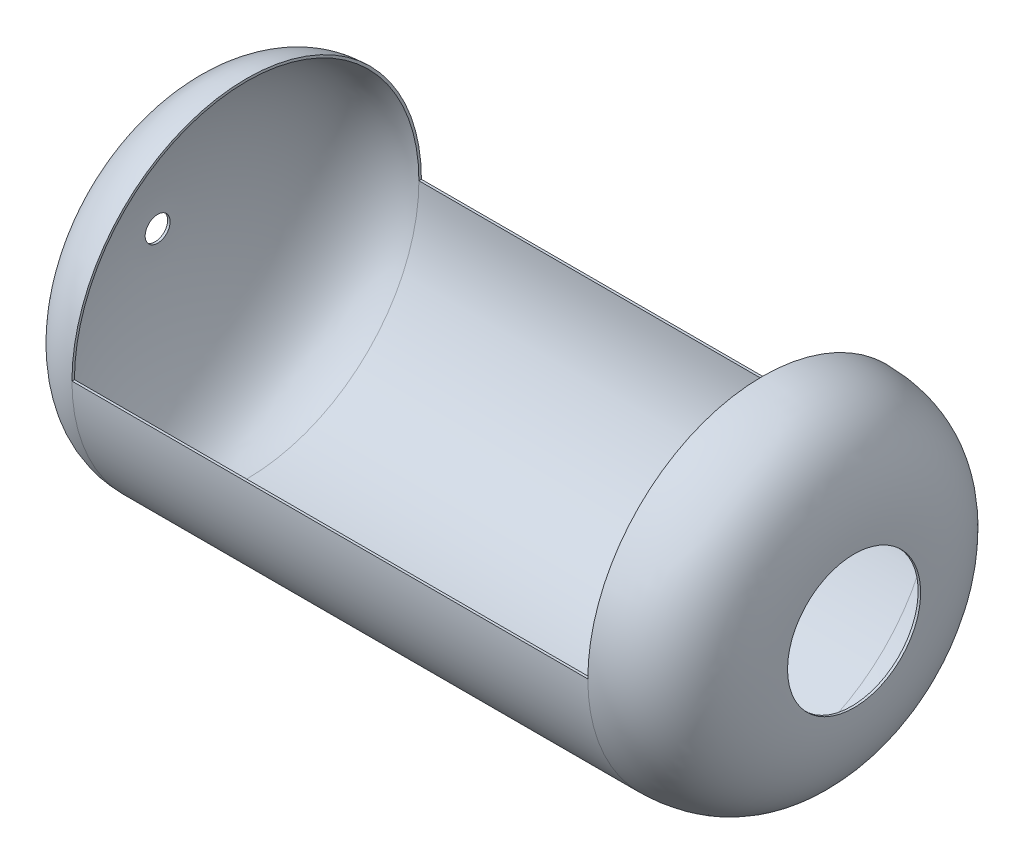
ISO-10303-21;
HEADER;
FILE_DESCRIPTION(('STEP AP214'),'2;1');
FILE_NAME('part.step','',(''),(''),'','','');
FILE_SCHEMA(('AUTOMOTIVE_DESIGN { 1 0 10303 214 1 1 1 1 }'));
ENDSEC;
DATA;
#1=APPLICATION_CONTEXT('core data for automotive mechanical design processes');
#2=APPLICATION_PROTOCOL_DEFINITION('international standard','automotive_design',2000,#1);
#3=PRODUCT_CONTEXT('',#1,'mechanical');
#4=PRODUCT('Part','Part','',(#3));
#5=PRODUCT_RELATED_PRODUCT_CATEGORY('part','',(#4));
#6=PRODUCT_DEFINITION_FORMATION('','',#4);
#7=PRODUCT_DEFINITION_CONTEXT('part definition',#1,'design');
#8=PRODUCT_DEFINITION('design','',#6,#7);
#9=PRODUCT_DEFINITION_SHAPE('','',#8);
#10=(LENGTH_UNIT() NAMED_UNIT(*) SI_UNIT(.MILLI.,.METRE.));
#11=(NAMED_UNIT(*) PLANE_ANGLE_UNIT() SI_UNIT($,.RADIAN.));
#12=(NAMED_UNIT(*) SI_UNIT($,.STERADIAN.) SOLID_ANGLE_UNIT());
#13=UNCERTAINTY_MEASURE_WITH_UNIT(LENGTH_MEASURE(1.E-05),#10,'distance_accuracy_value','');
#14=(GEOMETRIC_REPRESENTATION_CONTEXT(3) GLOBAL_UNCERTAINTY_ASSIGNED_CONTEXT((#13)) GLOBAL_UNIT_ASSIGNED_CONTEXT((#10,
#11,#12)) REPRESENTATION_CONTEXT('',''));
#15=CARTESIAN_POINT('',(0.,0.,0.));
#16=DIRECTION('',(0.,0.,1.));
#17=DIRECTION('',(1.,0.,0.));
#18=AXIS2_PLACEMENT_3D('',#15,#16,#17);
#19=CARTESIAN_POINT('',(-396.592099755992,0.,312.435963201851));
#20=DIRECTION('',(-1.,0.,0.));
#21=DIRECTION('',(0.,0.,1.));
#22=AXIS2_PLACEMENT_3D('',#19,#20,#21);
#23=CYLINDRICAL_SURFACE('',#22,210.);
#24=DIRECTION('',(-1.,0.,0.));
#25=VECTOR('',#24,1.);
#26=CARTESIAN_POINT('',(-396.592099755992,0.,102.435963201851));
#27=LINE('',#26,#25);
#28=CARTESIAN_POINT('',(581.58387703481,0.,102.435963201851));
#29=VERTEX_POINT('',#28);
#30=CARTESIAN_POINT('',(-38.4161229651903,0.,102.435963201851));
#31=VERTEX_POINT('',#30);
#32=EDGE_CURVE('E102',#29,#31,#27,.T.);
#33=ORIENTED_EDGE('',*,*,#32,.F.);
#34=CARTESIAN_POINT('',(581.58387703481,0.,312.435963201851));
#35=DIRECTION('',(-1.,0.,0.));
#36=DIRECTION('',(0.,0.,1.));
#37=AXIS2_PLACEMENT_3D('',#34,#35,#36);
#38=CIRCLE('',#37,210.);
#39=CARTESIAN_POINT('',(581.58387703481,0.,522.435963201851));
#40=VERTEX_POINT('',#39);
#41=EDGE_CURVE('E100',#29,#40,#38,.T.);
#42=ORIENTED_EDGE('',*,*,#41,.T.);
#43=DIRECTION('',(-1.,0.,0.));
#44=VECTOR('',#43,1.);
#45=CARTESIAN_POINT('',(-396.592099755992,0.,522.435963201851));
#46=LINE('',#45,#44);
#47=CARTESIAN_POINT('',(-38.4161229651903,0.,522.435963201851));
#48=VERTEX_POINT('',#47);
#49=EDGE_CURVE('E90',#48,#40,#46,.F.);
#50=ORIENTED_EDGE('',*,*,#49,.F.);
#51=CARTESIAN_POINT('',(-38.4161229651903,0.,312.435963201851));
#52=DIRECTION('',(-1.,0.,0.));
#53=DIRECTION('',(0.,0.,1.));
#54=AXIS2_PLACEMENT_3D('',#51,#52,#53);
#55=CIRCLE('',#54,210.);
#56=EDGE_CURVE('E86',#31,#48,#55,.T.);
#57=ORIENTED_EDGE('',*,*,#56,.F.);
#58=EDGE_LOOP('',(#33,#42,#50,#57));
#59=FACE_BOUND('',#58,.T.);
#60=ADVANCED_FACE('F33',(#59),#23,.T.);
#61=CARTESIAN_POINT('',(581.572240946435,0.,105.435963201855));
#62=CARTESIAN_POINT('',(582.424150652376,0.,105.442600659164));
#63=CARTESIAN_POINT('',(584.137918536488,0.,105.468851394561));
#64=CARTESIAN_POINT('',(587.484086921425,0.,105.571526795944));
#65=CARTESIAN_POINT('',(591.571096113027,0.,105.792916991487));
#66=CARTESIAN_POINT('',(596.307608868529,0.,106.202626940194));
#67=CARTESIAN_POINT('',(602.409126826052,0.,106.934758125947));
#68=CARTESIAN_POINT('',(609.639419086535,0.,108.18665602962));
#69=CARTESIAN_POINT('',(617.70585707123,0.,110.190510235831));
#70=CARTESIAN_POINT('',(625.186745255784,0.,112.659295821792));
#71=CARTESIAN_POINT('',(634.414245375346,0.,116.523312816482));
#72=CARTESIAN_POINT('',(644.61207372756,0.,122.339029978004));
#73=CARTESIAN_POINT('',(654.913796391652,0.,130.630357057189));
#74=CARTESIAN_POINT('',(663.46928585493,0.,139.982021209339));
#75=CARTESIAN_POINT('',(670.45039121658,0.,150.141502012286));
#76=CARTESIAN_POINT('',(676.016737994154,0.,160.847618744532));
#77=CARTESIAN_POINT('',(680.323342135693,0.,171.82903786729));
#78=CARTESIAN_POINT('',(683.525745860682,0.,182.806951111899));
#79=CARTESIAN_POINT('',(685.782094183419,0.,193.498408860527));
#80=CARTESIAN_POINT('',(687.253383878059,0.,203.618874423817));
#81=CARTESIAN_POINT('',(687.961369137142,0.,211.33978533163));
#82=CARTESIAN_POINT('',(688.299442483134,0.,216.947462036163));
#83=CARTESIAN_POINT('',(688.459593049096,0.,220.834002423392));
#84=CARTESIAN_POINT('',(688.547117141363,0.,224.365875374698));
#85=CARTESIAN_POINT('',(688.582824388612,0.,227.512914090602));
#86=CARTESIAN_POINT('',(688.586742369723,0.,229.777140480908));
#87=CARTESIAN_POINT('',(688.584795316882,0.,231.383827188645));
#88=CARTESIAN_POINT('',(688.583877034809,0.,232.075985648928));
#89=CARTESIAN_POINT('',(688.583877034809,0.,232.435963191891));
#90=B_SPLINE_CURVE_WITH_KNOTS('',3,(#61,#62,#63,#64,#65,#66,#67,#68,#69,#70,#71,#72,#73,#74,#75,
#76,#77,#78,#79,#80,#81,#82,#83,#84,#85,#86,#87,#88,#89),.UNSPECIFIED.,.F.,.F.,(4,1,1,1,1,1,1,1,
1,1,1,1,1,1,1,1,1,1,1,1,1,1,1,1,1,1,4),(3.49728876252685E-05,0.0078471996619407,
0.0156594264362561,0.031283879984887,0.0469083335335178,0.0625327870821487,0.0937816941794104,
0.125030601276672,0.156279508373934,0.187528415471196,0.250026229665719,0.312524043860242,
0.375021858054766,0.437519672249289,0.500017486443813,0.562515300638336,0.625013114832859,
0.687510929027383,0.750008743221906,0.81250655741643,0.843755464513691,0.875004371610953,
0.906253278708215,0.937502185805477,0.968751092902738,0.984375546451369,1.),.UNSPECIFIED.);
#91=CARTESIAN_POINT('',(-396.592099755992,0.,312.435963201851));
#92=DIRECTION('',(-1.,0.,0.));
#93=AXIS1_PLACEMENT('',#91,#92);
#94=SURFACE_OF_REVOLUTION('',#90,#93);
#95=CARTESIAN_POINT('',(688.583877034809,0.,312.435963201851));
#96=DIRECTION('',(-1.,0.,0.));
#97=DIRECTION('',(0.,0.,1.));
#98=AXIS2_PLACEMENT_3D('',#95,#96,#97);
#99=CIRCLE('',#98,80.0000000099596);
#100=CARTESIAN_POINT('',(688.583877034809,0.,392.43596321181));
#101=VERTEX_POINT('',#100);
#102=EDGE_CURVE('E111',#101,#101,#99,.T.);
#103=ORIENTED_EDGE('',*,*,#102,.F.);
#104=EDGE_LOOP('',(#103));
#105=FACE_BOUND('',#104,.T.);
#106=CARTESIAN_POINT('',(581.572240946435,0.,105.435963201855));
#107=CARTESIAN_POINT('',(582.424150652376,0.,105.442600659164));
#108=CARTESIAN_POINT('',(584.137918536488,0.,105.468851394561));
#109=CARTESIAN_POINT('',(587.484086921425,0.,105.571526795944));
#110=CARTESIAN_POINT('',(591.571096113027,0.,105.792916991487));
#111=CARTESIAN_POINT('',(596.307608868529,0.,106.202626940194));
#112=CARTESIAN_POINT('',(602.409126826052,0.,106.934758125947));
#113=CARTESIAN_POINT('',(609.639419086535,0.,108.18665602962));
#114=CARTESIAN_POINT('',(617.70585707123,0.,110.190510235831));
#115=CARTESIAN_POINT('',(625.186745255784,0.,112.659295821792));
#116=CARTESIAN_POINT('',(634.414245375346,0.,116.523312816482));
#117=CARTESIAN_POINT('',(644.61207372756,0.,122.339029978004));
#118=CARTESIAN_POINT('',(654.913796391652,0.,130.630357057189));
#119=CARTESIAN_POINT('',(663.46928585493,0.,139.982021209339));
#120=CARTESIAN_POINT('',(670.45039121658,0.,150.141502012286));
#121=CARTESIAN_POINT('',(676.016737994154,0.,160.847618744532));
#122=CARTESIAN_POINT('',(680.323342135693,0.,171.82903786729));
#123=CARTESIAN_POINT('',(683.525745860682,0.,182.806951111899));
#124=CARTESIAN_POINT('',(685.782094183419,0.,193.498408860527));
#125=CARTESIAN_POINT('',(687.253383878059,0.,203.618874423817));
#126=CARTESIAN_POINT('',(687.961369137142,0.,211.33978533163));
#127=CARTESIAN_POINT('',(688.299442483134,0.,216.947462036163));
#128=CARTESIAN_POINT('',(688.459593049096,0.,220.834002423392));
#129=CARTESIAN_POINT('',(688.547117141363,0.,224.365875374698));
#130=CARTESIAN_POINT('',(688.582824388612,0.,227.512914090602));
#131=CARTESIAN_POINT('',(688.586742369723,0.,229.777140480908));
#132=CARTESIAN_POINT('',(688.584795316882,0.,231.383827188645));
#133=CARTESIAN_POINT('',(688.583877034809,0.,232.075985648928));
#134=CARTESIAN_POINT('',(688.583877034809,0.,232.435963191891));
#135=B_SPLINE_CURVE_WITH_KNOTS('',3,(#106,#107,#108,#109,#110,#111,#112,#113,#114,#115,#116,
#117,#118,#119,#120,#121,#122,#123,#124,#125,#126,#127,#128,#129,#130,#131,#132,#133,#134),
.UNSPECIFIED.,.F.,.F.,(4,1,1,1,1,1,1,1,1,1,1,1,1,1,1,1,1,1,1,1,1,1,1,1,1,1,4),
(3.49728876252685E-05,0.0078471996619407,0.0156594264362561,0.031283879984887,
0.0469083335335178,0.0625327870821487,0.0937816941794104,0.125030601276672,0.156279508373934,
0.187528415471196,0.250026229665719,0.312524043860242,0.375021858054766,0.437519672249289,
0.500017486443813,0.562515300638336,0.625013114832859,0.687510929027383,0.750008743221906,
0.81250655741643,0.843755464513691,0.875004371610953,0.906253278708215,0.937502185805477,
0.968751092902738,0.984375546451369,1.),.UNSPECIFIED.);
#136=CARTESIAN_POINT('',(581.572240946435,0.,105.435966502601));
#137=VERTEX_POINT('',#136);
#138=CARTESIAN_POINT('',(581.58387703481,0.,105.436054262773));
#139=VERTEX_POINT('',#138);
#140=EDGE_CURVE('E103',#137,#139,#135,.T.);
#141=ORIENTED_EDGE('',*,*,#140,.F.);
#142=CARTESIAN_POINT('',(581.572240946435,0.,312.435963201851));
#143=DIRECTION('',(-1.,0.,0.));
#144=DIRECTION('',(0.,0.,1.));
#145=AXIS2_PLACEMENT_3D('',#142,#143,#144);
#146=CIRCLE('',#145,206.999999999996);
#147=CARTESIAN_POINT('',(581.572240946435,0.,519.4359599011));
#148=VERTEX_POINT('',#147);
#149=EDGE_CURVE('E114',#137,#148,#146,.T.);
#150=ORIENTED_EDGE('',*,*,#149,.T.);
#151=CARTESIAN_POINT('',(581.572240946435,0.,519.435963201847));
#152=CARTESIAN_POINT('',(582.424150652376,0.,519.429325744537));
#153=CARTESIAN_POINT('',(584.137918536488,0.,519.40307500914));
#154=CARTESIAN_POINT('',(587.484086921425,0.,519.300399607757));
#155=CARTESIAN_POINT('',(591.571096113027,0.,519.079009412215));
#156=CARTESIAN_POINT('',(596.307608868529,0.,518.669299463507));
#157=CARTESIAN_POINT('',(602.409126826052,0.,517.937168277754));
#158=CARTESIAN_POINT('',(609.639419086535,0.,516.685270374081));
#159=CARTESIAN_POINT('',(617.70585707123,0.,514.68141616787));
#160=CARTESIAN_POINT('',(625.186745255784,0.,512.212630581909));
#161=CARTESIAN_POINT('',(634.414245375346,0.,508.34861358722));
#162=CARTESIAN_POINT('',(644.61207372756,0.,502.532896425697));
#163=CARTESIAN_POINT('',(654.913796391652,0.,494.241569346513));
#164=CARTESIAN_POINT('',(663.46928585493,0.,484.889905194362));
#165=CARTESIAN_POINT('',(670.45039121658,0.,474.730424391415));
#166=CARTESIAN_POINT('',(676.016737994154,0.,464.024307659169));
#167=CARTESIAN_POINT('',(680.323342135693,0.,453.042888536411));
#168=CARTESIAN_POINT('',(683.525745860682,0.,442.064975291802));
#169=CARTESIAN_POINT('',(685.782094183419,0.,431.373517543175));
#170=CARTESIAN_POINT('',(687.253383878059,0.,421.253051979885));
#171=CARTESIAN_POINT('',(687.961369137142,0.,413.532141072071));
#172=CARTESIAN_POINT('',(688.299442483134,0.,407.924464367538));
#173=CARTESIAN_POINT('',(688.459593049096,0.,404.03792398031));
#174=CARTESIAN_POINT('',(688.547117141363,0.,400.506051029004));
#175=CARTESIAN_POINT('',(688.582824388612,0.,397.359012313099));
#176=CARTESIAN_POINT('',(688.586742369723,0.,395.094785922793));
#177=CARTESIAN_POINT('',(688.584795316882,0.,393.488099215056));
#178=CARTESIAN_POINT('',(688.583877034809,0.,392.795940754773));
#179=CARTESIAN_POINT('',(688.583877034809,0.,392.43596321181));
#180=B_SPLINE_CURVE_WITH_KNOTS('',3,(#151,#152,#153,#154,#155,#156,#157,#158,#159,#160,#161,
#162,#163,#164,#165,#166,#167,#168,#169,#170,#171,#172,#173,#174,#175,#176,#177,#178,#179),
.UNSPECIFIED.,.F.,.F.,(4,1,1,1,1,1,1,1,1,1,1,1,1,1,1,1,1,1,1,1,1,1,1,1,1,1,4),
(3.49728876252685E-05,0.0078471996619407,0.0156594264362561,0.031283879984887,
0.0469083335335178,0.0625327870821487,0.0937816941794104,0.125030601276672,0.156279508373934,
0.187528415471196,0.250026229665719,0.312524043860242,0.375021858054766,0.437519672249289,
0.500017486443813,0.562515300638336,0.625013114832859,0.687510929027383,0.750008743221906,
0.81250655741643,0.843755464513691,0.875004371610953,0.906253278708215,0.937502185805477,
0.968751092902738,0.984375546451369,1.),.UNSPECIFIED.);
#181=CARTESIAN_POINT('',(581.58387703481,0.,519.435872140929));
#182=VERTEX_POINT('',#181);
#183=EDGE_CURVE('E187',#182,#148,#180,.F.);
#184=ORIENTED_EDGE('',*,*,#183,.F.);
#185=CARTESIAN_POINT('',(581.58387703481,0.,312.435963201851));
#186=DIRECTION('',(-1.,0.,0.));
#187=DIRECTION('',(0.,0.,1.));
#188=AXIS2_PLACEMENT_3D('',#185,#186,#187);
#189=CIRCLE('',#188,206.999908939078);
#190=EDGE_CURVE('E11',#182,#139,#189,.T.);
#191=ORIENTED_EDGE('',*,*,#190,.T.);
#192=EDGE_LOOP('',(#141,#150,#184,#191));
#193=FACE_BOUND('',#192,.T.);
#194=ADVANCED_FACE('F145',(#105,#193),#94,.T.);
#195=CARTESIAN_POINT('',(-396.592099755992,0.,312.435963201851));
#196=DIRECTION('',(-1.,0.,0.));
#197=DIRECTION('',(0.,0.,1.));
#198=AXIS2_PLACEMENT_3D('',#195,#196,#197);
#199=CYLINDRICAL_SURFACE('',#198,206.999996699249);
#200=DIRECTION('',(-1.,0.,0.));
#201=VECTOR('',#200,1.);
#202=CARTESIAN_POINT('',(-396.592099755992,0.,105.435966502601));
#203=LINE('',#202,#201);
#204=CARTESIAN_POINT('',(-38.4161229511558,0.,105.435969803348));
#205=VERTEX_POINT('',#204);
#206=EDGE_CURVE('E182',#205,#137,#203,.F.);
#207=ORIENTED_EDGE('',*,*,#206,.F.);
#208=CARTESIAN_POINT('',(-38.4161229511558,0.,312.435963201851));
#209=DIRECTION('',(-1.,0.,0.));
#210=DIRECTION('',(0.,0.,1.));
#211=AXIS2_PLACEMENT_3D('',#208,#209,#210);
#212=CIRCLE('',#211,206.999993398502);
#213=CARTESIAN_POINT('',(-38.4161229511558,0.,519.435956600353));
#214=VERTEX_POINT('',#213);
#215=EDGE_CURVE('E119',#205,#214,#212,.T.);
#216=ORIENTED_EDGE('',*,*,#215,.T.);
#217=DIRECTION('',(-1.,0.,0.));
#218=VECTOR('',#217,1.);
#219=CARTESIAN_POINT('',(-396.592099755992,0.,519.4359599011));
#220=LINE('',#219,#218);
#221=EDGE_CURVE('E93',#148,#214,#220,.T.);
#222=ORIENTED_EDGE('',*,*,#221,.F.);
#223=ORIENTED_EDGE('',*,*,#149,.F.);
#224=EDGE_LOOP('',(#207,#216,#222,#223));
#225=FACE_BOUND('',#224,.T.);
#226=ADVANCED_FACE('F149',(#225),#199,.F.);
#227=CARTESIAN_POINT('',(-38.4161229651902,0.,102.435963201851));
#228=CARTESIAN_POINT('',(-139.444928362584,0.,102.644054250212));
#229=CARTESIAN_POINT('',(-148.369931416815,0.,286.572993540272));
#230=CARTESIAN_POINT('',(-148.41612296519,0.,297.435963201851));
#231=B_SPLINE_CURVE_WITH_KNOTS('',3,(#227,#228,#229,#230),.UNSPECIFIED.,.F.,.F.,(4,4),(0.,1.),.UNSPECIFIED.);
#232=CARTESIAN_POINT('',(-396.592099755992,0.,312.435963201851));
#233=DIRECTION('',(-1.,0.,0.));
#234=AXIS1_PLACEMENT('',#232,#233);
#235=SURFACE_OF_REVOLUTION('',#231,#234);
#236=CARTESIAN_POINT('',(-148.41612296519,0.,312.435963201851));
#237=DIRECTION('',(-1.,0.,0.));
#238=DIRECTION('',(0.,0.,1.));
#239=AXIS2_PLACEMENT_3D('',#236,#237,#238);
#240=CIRCLE('',#239,15.);
#241=CARTESIAN_POINT('',(-148.41612296519,0.,327.435963201851));
#242=VERTEX_POINT('',#241);
#243=EDGE_CURVE('E123',#242,#242,#240,.T.);
#244=ORIENTED_EDGE('',*,*,#243,.F.);
#245=EDGE_LOOP('',(#244));
#246=FACE_BOUND('',#245,.T.);
#247=EDGE_CURVE('E42',#48,#31,#55,.T.);
#248=ORIENTED_EDGE('',*,*,#247,.T.);
#249=ORIENTED_EDGE('',*,*,#56,.T.);
#250=EDGE_LOOP('',(#248,#249));
#251=FACE_BOUND('',#250,.T.);
#252=ADVANCED_FACE('F35',(#246,#251),#235,.T.);
#253=CARTESIAN_POINT('',(691.58387703481,0.,232.435963191891));
#254=CARTESIAN_POINT('',(691.58387703481,0.,210.802397540345));
#255=CARTESIAN_POINT('',(693.455539680945,0.,103.300064726553));
#256=CARTESIAN_POINT('',(581.58387703481,0.,102.435963201851));
#257=B_SPLINE_CURVE_WITH_KNOTS('',3,(#253,#254,#255,#256),.UNSPECIFIED.,.F.,.F.,(4,4),(0.,1.),.UNSPECIFIED.);
#258=CARTESIAN_POINT('',(-396.592099755992,0.,312.435963201851));
#259=DIRECTION('',(-1.,0.,0.));
#260=AXIS1_PLACEMENT('',#258,#259);
#261=SURFACE_OF_REVOLUTION('',#257,#260);
#262=EDGE_CURVE('E105',#40,#29,#38,.T.);
#263=ORIENTED_EDGE('',*,*,#262,.F.);
#264=ORIENTED_EDGE('',*,*,#41,.F.);
#265=EDGE_LOOP('',(#263,#264));
#266=FACE_BOUND('',#265,.T.);
#267=CARTESIAN_POINT('',(691.58387703481,0.,312.435963201851));
#268=DIRECTION('',(-1.,0.,0.));
#269=DIRECTION('',(0.,0.,1.));
#270=AXIS2_PLACEMENT_3D('',#267,#268,#269);
#271=CIRCLE('',#270,80.0000000099597);
#272=CARTESIAN_POINT('',(691.58387703481,0.,392.43596321181));
#273=VERTEX_POINT('',#272);
#274=EDGE_CURVE('E108',#273,#273,#271,.T.);
#275=ORIENTED_EDGE('',*,*,#274,.T.);
#276=EDGE_LOOP('',(#275));
#277=FACE_BOUND('',#276,.T.);
#278=ADVANCED_FACE('F138',(#266,#277),#261,.T.);
#279=CARTESIAN_POINT('',(-396.592099755992,0.,312.435963201851));
#280=DIRECTION('',(-1.,0.,0.));
#281=DIRECTION('',(0.,0.,1.));
#282=AXIS2_PLACEMENT_3D('',#279,#280,#281);
#283=CYLINDRICAL_SURFACE('',#282,80.0000000099596);
#284=ORIENTED_EDGE('',*,*,#274,.F.);
#285=EDGE_LOOP('',(#284));
#286=FACE_BOUND('',#285,.T.);
#287=ORIENTED_EDGE('',*,*,#102,.T.);
#288=EDGE_LOOP('',(#287));
#289=FACE_BOUND('',#288,.T.);
#290=ADVANCED_FACE('F141',(#286,#289),#283,.F.);
#291=CARTESIAN_POINT('',(-145.416150086663,0.,297.448719694473));
#292=CARTESIAN_POINT('',(-145.415786094298,0.,297.363118796502));
#293=CARTESIAN_POINT('',(-145.414261277934,0.,297.20911730245));
#294=CARTESIAN_POINT('',(-145.406482155651,0.,296.763589126672));
#295=CARTESIAN_POINT('',(-145.387577620609,0.,296.059017238237));
#296=CARTESIAN_POINT('',(-145.348080967221,0.,294.963719442348));
#297=CARTESIAN_POINT('',(-145.270536884929,0.,293.196191662837));
#298=CARTESIAN_POINT('',(-145.122211689876,0.,290.430217628076));
#299=CARTESIAN_POINT('',(-144.846888777165,0.,286.292241123749));
#300=CARTESIAN_POINT('',(-144.45910675805,0.,281.402026012898));
#301=CARTESIAN_POINT('',(-143.771963774074,0.,273.967299792116));
#302=CARTESIAN_POINT('',(-142.556325425144,0.,263.124157441771));
#303=CARTESIAN_POINT('',(-140.406308296418,0.,248.159348272448));
#304=CARTESIAN_POINT('',(-137.445210778672,0.,231.767940973261));
#305=CARTESIAN_POINT('',(-133.554303610322,0.,214.477141353481));
#306=CARTESIAN_POINT('',(-128.616651258736,0.,196.815263659723));
#307=CARTESIAN_POINT('',(-122.518262583079,0.,179.311948455228));
#308=CARTESIAN_POINT('',(-115.149922932418,0.,162.497881736228));
#309=CARTESIAN_POINT('',(-106.409989846741,0.,146.903194531391));
#310=CARTESIAN_POINT('',(-96.207058742148,0.,133.052336159925));
#311=CARTESIAN_POINT('',(-86.41798962401,0.,123.386032183094));
#312=CARTESIAN_POINT('',(-77.7696322883715,0.,117.014146282053));
#313=CARTESIAN_POINT('',(-70.8591720339328,0.,112.970513687566));
#314=CARTESIAN_POINT('',(-63.5047480746761,0.,109.716446775653));
#315=CARTESIAN_POINT('',(-56.9853432508552,0.,107.708604585189));
#316=CARTESIAN_POINT('',(-51.5204134098119,0.,106.554160282658));
#317=CARTESIAN_POINT('',(-47.2940970569106,0.,105.922162764636));
#318=CARTESIAN_POINT('',(-43.6594739871722,0.,105.597170774379));
#319=CARTESIAN_POINT('',(-40.6894672361361,0.,105.462466746088));
#320=CARTESIAN_POINT('',(-39.1712349274586,0.,105.437583268602));
#321=CARTESIAN_POINT('',(-38.4161229511558,0.,105.435969803348));
#322=B_SPLINE_CURVE_WITH_KNOTS('',3,(#291,#292,#293,#294,#295,#296,#297,#298,#299,#300,#301,
#302,#303,#304,#305,#306,#307,#308,#309,#310,#311,#312,#313,#314,#315,#316,#317,#318,#319,#320,
#321),.UNSPECIFIED.,.F.,.F.,(4,1,1,1,1,1,1,1,1,1,1,1,1,1,1,1,1,1,1,1,1,1,1,1,1,1,1,1,4),
(2.11499559823469E-05,0.00783348472195122,0.0156458194879201,0.0312704890198579,
0.0468951585517956,0.0625198280837335,0.0937691671476091,0.125018506211485,0.15626784527536,
0.187517184339236,0.250015862466987,0.312514540594738,0.375013218722489,0.43751189685024,
0.500010574977991,0.562509253105742,0.625007931233493,0.687506609361245,0.750005287488996,
0.812503965616747,0.843753304680622,0.875002643744498,0.906251982808373,0.937501321872249,
0.953125991404187,0.968750660936124,0.984375330468062,0.992187665234031,1.),.UNSPECIFIED.);
#323=CARTESIAN_POINT('',(-396.592099755992,0.,312.435963201851));
#324=DIRECTION('',(-1.,0.,0.));
#325=AXIS1_PLACEMENT('',#323,#324);
#326=SURFACE_OF_REVOLUTION('',#322,#325);
#327=EDGE_CURVE('E117',#214,#205,#212,.T.);
#328=ORIENTED_EDGE('',*,*,#327,.F.);
#329=ORIENTED_EDGE('',*,*,#215,.F.);
#330=EDGE_LOOP('',(#328,#329));
#331=FACE_BOUND('',#330,.T.);
#332=CARTESIAN_POINT('',(-145.416150086663,0.,312.435963201851));
#333=DIRECTION('',(-1.,0.,0.));
#334=DIRECTION('',(0.,0.,1.));
#335=AXIS2_PLACEMENT_3D('',#332,#333,#334);
#336=CIRCLE('',#335,14.9872435073777);
#337=CARTESIAN_POINT('',(-145.416150086663,0.,327.423206709228));
#338=VERTEX_POINT('',#337);
#339=EDGE_CURVE('E120',#338,#338,#336,.T.);
#340=ORIENTED_EDGE('',*,*,#339,.T.);
#341=EDGE_LOOP('',(#340));
#342=FACE_BOUND('',#341,.T.);
#343=ADVANCED_FACE('F159',(#331,#342),#326,.T.);
#344=CARTESIAN_POINT('',(-148.41612296519,0.,312.435963201851));
#345=DIRECTION('',(-1.,0.,0.));
#346=DIRECTION('',(0.,0.,1.));
#347=AXIS2_PLACEMENT_3D('',#344,#345,#346);
#348=CONICAL_SURFACE('',#347,15.,0.00425217702135646);
#349=ORIENTED_EDGE('',*,*,#339,.F.);
#350=EDGE_LOOP('',(#349));
#351=FACE_BOUND('',#350,.T.);
#352=ORIENTED_EDGE('',*,*,#243,.T.);
#353=EDGE_LOOP('',(#352));
#354=FACE_BOUND('',#353,.T.);
#355=ADVANCED_FACE('F162',(#351,#354),#348,.F.);
#356=CARTESIAN_POINT('',(581.58387703481,0.,0.));
#357=DIRECTION('',(1.,0.,0.));
#358=DIRECTION('',(0.,1.,0.));
#359=AXIS2_PLACEMENT_3D('',#356,#357,#358);
#360=PLANE('',#359);
#361=DIRECTION('',(0.,0.,-1.));
#362=VECTOR('',#361,1.);
#363=CARTESIAN_POINT('',(581.58387703481,0.,737.495931307423));
#364=LINE('',#363,#362);
#365=EDGE_CURVE('E95',#139,#29,#364,.T.);
#366=ORIENTED_EDGE('',*,*,#365,.F.);
#367=ORIENTED_EDGE('',*,*,#190,.F.);
#368=EDGE_CURVE('E49',#40,#182,#364,.T.);
#369=ORIENTED_EDGE('',*,*,#368,.F.);
#370=ORIENTED_EDGE('',*,*,#262,.T.);
#371=EDGE_LOOP('',(#366,#367,#369,#370));
#372=FACE_BOUND('',#371,.T.);
#373=ADVANCED_FACE('F207',(#372),#360,.F.);
#374=CARTESIAN_POINT('',(1604.84151052828,0.,737.495931307423));
#375=DIRECTION('',(0.,1.,0.));
#376=DIRECTION('',(-1.,0.,0.));
#377=AXIS2_PLACEMENT_3D('',#374,#375,#376);
#378=PLANE('',#377);
#379=ORIENTED_EDGE('',*,*,#32,.T.);
#380=DIRECTION('',(0.,0.,-1.));
#381=VECTOR('',#380,1.);
#382=CARTESIAN_POINT('',(-38.4161229651903,0.,737.495931307423));
#383=LINE('',#382,#381);
#384=EDGE_CURVE('E82',#205,#31,#383,.T.);
#385=ORIENTED_EDGE('',*,*,#384,.F.);
#386=ORIENTED_EDGE('',*,*,#206,.T.);
#387=ORIENTED_EDGE('',*,*,#140,.T.);
#388=ORIENTED_EDGE('',*,*,#365,.T.);
#389=EDGE_LOOP('',(#379,#385,#386,#387,#388));
#390=FACE_BOUND('',#389,.T.);
#391=ADVANCED_FACE('F205',(#390),#378,.T.);
#392=ORIENTED_EDGE('',*,*,#49,.T.);
#393=ORIENTED_EDGE('',*,*,#368,.T.);
#394=ORIENTED_EDGE('',*,*,#183,.T.);
#395=ORIENTED_EDGE('',*,*,#221,.T.);
#396=EDGE_CURVE('E57',#48,#214,#383,.T.);
#397=ORIENTED_EDGE('',*,*,#396,.F.);
#398=EDGE_LOOP('',(#392,#393,#394,#395,#397));
#399=FACE_BOUND('',#398,.T.);
#400=ADVANCED_FACE('F89',(#399),#378,.T.);
#401=CARTESIAN_POINT('',(-38.4161229651903,0.,0.));
#402=DIRECTION('',(1.,0.,0.));
#403=DIRECTION('',(0.,1.,0.));
#404=AXIS2_PLACEMENT_3D('',#401,#402,#403);
#405=PLANE('',#404);
#406=ORIENTED_EDGE('',*,*,#247,.F.);
#407=ORIENTED_EDGE('',*,*,#396,.T.);
#408=ORIENTED_EDGE('',*,*,#327,.T.);
#409=ORIENTED_EDGE('',*,*,#384,.T.);
#410=EDGE_LOOP('',(#406,#407,#408,#409));
#411=FACE_BOUND('',#410,.T.);
#412=ADVANCED_FACE('F80',(#411),#405,.T.);
#413=CLOSED_SHELL('',(#60,#194,#226,#252,#278,#290,#343,#355,#373,#391,#400,#412));
#414=MANIFOLD_SOLID_BREP('B2',#413);
#415=ADVANCED_BREP_SHAPE_REPRESENTATION('',(#18,#414),#14);
#416=SHAPE_DEFINITION_REPRESENTATION(#9,#415);
ENDSEC;
END-ISO-10303-21;
